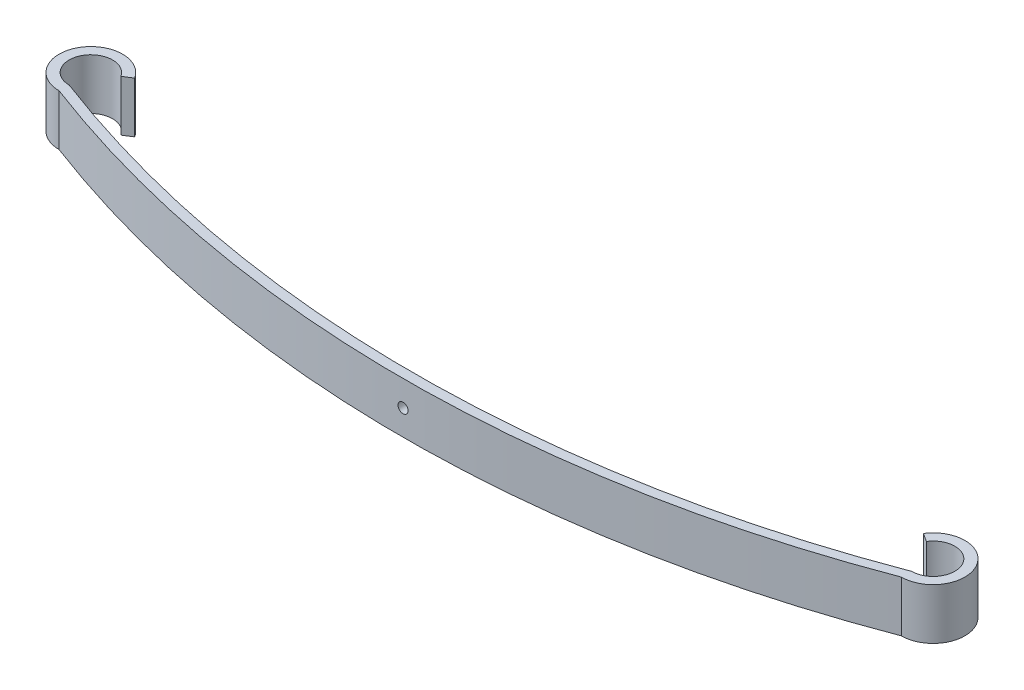
ISO-10303-21;
HEADER;
FILE_DESCRIPTION(('STEP AP214'),'2;1');
FILE_NAME('part.step','',(''),(''),'','','');
FILE_SCHEMA(('AUTOMOTIVE_DESIGN { 1 0 10303 214 1 1 1 1 }'));
ENDSEC;
DATA;
#1=APPLICATION_CONTEXT('core data for automotive mechanical design processes');
#2=APPLICATION_PROTOCOL_DEFINITION('international standard','automotive_design',2000,#1);
#3=PRODUCT_CONTEXT('',#1,'mechanical');
#4=PRODUCT('Part','Part','',(#3));
#5=PRODUCT_RELATED_PRODUCT_CATEGORY('part','',(#4));
#6=PRODUCT_DEFINITION_FORMATION('','',#4);
#7=PRODUCT_DEFINITION_CONTEXT('part definition',#1,'design');
#8=PRODUCT_DEFINITION('design','',#6,#7);
#9=PRODUCT_DEFINITION_SHAPE('','',#8);
#10=(LENGTH_UNIT() NAMED_UNIT(*) SI_UNIT(.MILLI.,.METRE.));
#11=(NAMED_UNIT(*) PLANE_ANGLE_UNIT() SI_UNIT($,.RADIAN.));
#12=(NAMED_UNIT(*) SI_UNIT($,.STERADIAN.) SOLID_ANGLE_UNIT());
#13=UNCERTAINTY_MEASURE_WITH_UNIT(LENGTH_MEASURE(1.E-05),#10,'distance_accuracy_value','');
#14=(GEOMETRIC_REPRESENTATION_CONTEXT(3) GLOBAL_UNCERTAINTY_ASSIGNED_CONTEXT((#13)) GLOBAL_UNIT_ASSIGNED_CONTEXT((#10,
#11,#12)) REPRESENTATION_CONTEXT('',''));
#15=CARTESIAN_POINT('',(0.,0.,0.));
#16=DIRECTION('',(0.,0.,1.));
#17=DIRECTION('',(1.,0.,0.));
#18=AXIS2_PLACEMENT_3D('',#15,#16,#17);
#19=CARTESIAN_POINT('',(0.,76.2,-1613.04997748712));
#20=DIRECTION('',(0.,-1.,0.));
#21=DIRECTION('',(0.,0.,-1.));
#22=AXIS2_PLACEMENT_3D('',#19,#20,#21);
#23=CYLINDRICAL_SURFACE('',#22,1776.04997748712);
#24=CARTESIAN_POINT('',(0.,0.,-1613.04997748712));
#25=DIRECTION('',(0.,1.,0.));
#26=DIRECTION('',(0.,0.,1.));
#27=AXIS2_PLACEMENT_3D('',#24,#25,#26);
#28=CIRCLE('',#27,1776.04997748712);
#29=CARTESIAN_POINT('',(-630.021699517165,0.,47.499985829101));
#30=VERTEX_POINT('',#29);
#31=CARTESIAN_POINT('',(630.021699517166,0.,47.4999858291005));
#32=VERTEX_POINT('',#31);
#33=EDGE_CURVE('E158',#30,#32,#28,.T.);
#34=ORIENTED_EDGE('',*,*,#33,.T.);
#35=DIRECTION('',(0.,-1.,0.));
#36=VECTOR('',#35,1.);
#37=CARTESIAN_POINT('',(630.021699517166,76.2,47.4999858291005));
#38=LINE('',#37,#36);
#39=CARTESIAN_POINT('',(630.021699517166,76.2,47.4999858291005));
#40=VERTEX_POINT('',#39);
#41=EDGE_CURVE('E178',#40,#32,#38,.T.);
#42=ORIENTED_EDGE('',*,*,#41,.F.);
#43=CARTESIAN_POINT('',(0.,76.2,-1613.04997748712));
#44=DIRECTION('',(0.,1.,0.));
#45=DIRECTION('',(0.,0.,1.));
#46=AXIS2_PLACEMENT_3D('',#43,#44,#45);
#47=CIRCLE('',#46,1776.04997748712);
#48=CARTESIAN_POINT('',(-630.021699517165,76.2,47.499985829101));
#49=VERTEX_POINT('',#48);
#50=EDGE_CURVE('E187',#49,#40,#47,.T.);
#51=ORIENTED_EDGE('',*,*,#50,.F.);
#52=DIRECTION('',(0.,-1.,0.));
#53=VECTOR('',#52,1.);
#54=CARTESIAN_POINT('',(-630.021699517165,76.2,47.499985829101));
#55=LINE('',#54,#53);
#56=EDGE_CURVE('E64',#49,#30,#55,.T.);
#57=ORIENTED_EDGE('',*,*,#56,.T.);
#58=EDGE_LOOP('',(#34,#42,#51,#57));
#59=FACE_BOUND('',#58,.T.);
#60=CARTESIAN_POINT('',(0.,30.6,163.));
#61=CARTESIAN_POINT('',(0.210713968094847,30.5999984867718,163.000000017793));
#62=CARTESIAN_POINT('',(0.421403110930927,30.6088837241473,162.999962421728));
#63=CARTESIAN_POINT('',(0.841354181845692,30.6443626478279,162.999813125687));
#64=CARTESIAN_POINT('',(1.05061571988433,30.6709609920997,162.999701406219));
#65=CARTESIAN_POINT('',(1.46633777348713,30.7417152082759,162.999406859924));
#66=CARTESIAN_POINT('',(1.6727956251238,30.7858867143384,162.999223969782));
#67=CARTESIAN_POINT('',(2.0813298290619,30.8914915499317,162.998792209094));
#68=CARTESIAN_POINT('',(2.28340455125413,30.9529311869032,162.99854331444));
#69=CARTESIAN_POINT('',(2.68152110119559,31.0925814227028,162.997986836868));
#70=CARTESIAN_POINT('',(2.87756687230425,31.1707807807116,162.997679293301));
#71=CARTESIAN_POINT('',(3.26237590887557,31.3434199132982,162.997014137911));
#72=CARTESIAN_POINT('',(3.45113906456141,31.4378599325678,162.996656525334));
#73=CARTESIAN_POINT('',(3.81998780496026,31.6422805388219,162.995901490769));
#74=CARTESIAN_POINT('',(4.00007570143526,31.7522569546407,162.995504079474));
#75=CARTESIAN_POINT('',(4.35035222525648,31.9869905222912,162.994680636077));
#76=CARTESIAN_POINT('',(4.52054062300158,32.1117480167399,162.994254603313));
#77=CARTESIAN_POINT('',(4.84979170206728,32.375145131617,162.993386048449));
#78=CARTESIAN_POINT('',(5.00885520931113,32.5137837196366,162.992943527577));
#79=CARTESIAN_POINT('',(5.31479308067832,32.8040158599574,162.992054369382));
#80=CARTESIAN_POINT('',(5.46166320475944,32.9556138817971,162.991607730686));
#81=CARTESIAN_POINT('',(5.74206362701646,33.2705952098568,162.990723311728));
#82=CARTESIAN_POINT('',(5.87559815641376,33.4339747494301,162.990285528692));
#83=CARTESIAN_POINT('',(6.12847828337052,33.771463069239,162.989430939818));
#84=CARTESIAN_POINT('',(6.24781862373926,33.9455757887633,162.989014141786));
#85=CARTESIAN_POINT('',(6.47138111476855,34.3032005309574,162.988213616074));
#86=CARTESIAN_POINT('',(6.57560639321553,34.4867105983519,162.987829881559));
#87=CARTESIAN_POINT('',(6.76822875919974,34.8618615632208,162.98710627353));
#88=CARTESIAN_POINT('',(6.85662560065949,35.0535025870461,162.986766400699));
#89=CARTESIAN_POINT('',(7.01695887812286,35.4435460971781,162.986140178145));
#90=CARTESIAN_POINT('',(7.08889566823637,35.641948437921,162.98585382727));
#91=CARTESIAN_POINT('',(7.21580133308615,36.044112738792,162.985342762279));
#92=CARTESIAN_POINT('',(7.27076981084063,36.2478748241927,162.985118049605));
#93=CARTESIAN_POINT('',(7.36333699178479,36.6592665254971,162.984736685149));
#94=CARTESIAN_POINT('',(7.40093897454986,36.8668954034654,162.984580020515));
#95=CARTESIAN_POINT('',(7.45853120590772,37.2846549482945,162.984339094535));
#96=CARTESIAN_POINT('',(7.47851535225072,37.4947864564644,162.984254858275));
#97=CARTESIAN_POINT('',(7.50070359679291,37.9159102543572,162.984161289859));
#98=CARTESIAN_POINT('',(7.50291408330493,38.1269022075305,162.98415193079));
#99=CARTESIAN_POINT('',(7.48955360463755,38.5484004665783,162.984208322118));
#100=CARTESIAN_POINT('',(7.47397607404442,38.7589065643845,162.984274100248));
#101=CARTESIAN_POINT('',(7.42514452560688,39.1778160268165,162.984478922777));
#102=CARTESIAN_POINT('',(7.39189401428336,39.386219800212,162.984617952642));
#103=CARTESIAN_POINT('',(7.30795445093884,39.7994886750945,162.984965325868));
#104=CARTESIAN_POINT('',(7.25726512758625,40.0043537214701,162.985173670307));
#105=CARTESIAN_POINT('',(7.13880941808649,40.4090816554474,162.985653753506));
#106=CARTESIAN_POINT('',(7.07104334628321,40.6089446350512,162.985925491099));
#107=CARTESIAN_POINT('',(6.9189140997809,41.0022558470403,162.986524655178));
#108=CARTESIAN_POINT('',(6.83455053674624,41.1957039292108,162.986852082966));
#109=CARTESIAN_POINT('',(6.64984230973384,41.5747716673123,162.987553267696));
#110=CARTESIAN_POINT('',(6.54950055498252,41.7603927405778,162.9879270162));
#111=CARTESIAN_POINT('',(6.33350673998429,42.122583443866,162.988710406047));
#112=CARTESIAN_POINT('',(6.21784939085645,42.2991499177426,162.989120059772));
#113=CARTESIAN_POINT('',(5.97209494733965,42.6418601532708,162.98996341449));
#114=CARTESIAN_POINT('',(5.84200303653203,42.8080076231485,162.990397106822));
#115=CARTESIAN_POINT('',(5.56830511634722,43.1287715124287,162.99127634415));
#116=CARTESIAN_POINT('',(5.42469413510144,43.2833836517498,162.991721893463));
#117=CARTESIAN_POINT('',(4.97502421482186,43.7281685004763,162.993057195178));
#118=CARTESIAN_POINT('',(4.64986305950484,43.9996590137956,162.993946551662));
#119=CARTESIAN_POINT('',(4.13197567971222,44.3627081259288,162.995201923407));
#120=CARTESIAN_POINT('',(3.95423770702106,44.4764002086073,162.99560743072));
#121=CARTESIAN_POINT('',(3.58980904910951,44.6884506790732,162.996381434127));
#122=CARTESIAN_POINT('',(3.40311815449504,44.7868087079934,162.996749929354));
#123=CARTESIAN_POINT('',(2.83165300721092,45.0576661242205,162.99778332722));
#124=CARTESIAN_POINT('',(2.4351711412673,45.2061693090257,162.998376934446));
#125=CARTESIAN_POINT('',(1.62308827124555,45.434416916634,162.999304792558));
#126=CARTESIAN_POINT('',(1.20748726904254,45.5141613461807,162.999639043471));
#127=CARTESIAN_POINT('',(0.368800144783214,45.6027859953174,163.000011208188));
#128=CARTESIAN_POINT('',(-0.054285919417941,45.6116667624026,163.000049124283));
#129=CARTESIAN_POINT('',(-0.896132618131327,45.5581931101371,162.999823726225));
#130=CARTESIAN_POINT('',(-1.31489325255173,45.4958386892741,162.999560412067));
#131=CARTESIAN_POINT('',(-1.930343678774,45.350406625668,162.998962948761));
#132=CARTESIAN_POINT('',(-2.13346696571789,45.2932419084602,162.998729895662));
#133=CARTESIAN_POINT('',(-2.53416331768187,45.162045795966,162.998203357605));
#134=CARTESIAN_POINT('',(-2.73173651249232,45.0880147954714,162.997909874061));
#135=CARTESIAN_POINT('',(-3.3140608467634,44.8412313409881,162.996950242197));
#136=CARTESIAN_POINT('',(-3.68878109502357,44.6437020734127,162.996204537467));
#137=CARTESIAN_POINT('',(-4.221481788554,44.302730393453,162.994991984489));
#138=CARTESIAN_POINT('',(-4.39423732139206,44.1815494254651,162.99457188216));
#139=CARTESIAN_POINT('',(-4.72893486876269,43.9250760102937,162.993712173886));
#140=CARTESIAN_POINT('',(-4.89088085068098,43.7897887877032,162.993272575197));
#141=CARTESIAN_POINT('',(-5.20283897410495,43.5060131269224,162.992386135607));
#142=CARTESIAN_POINT('',(-5.35284682055941,43.357519977882,162.991939292171));
#143=CARTESIAN_POINT('',(-5.63977310900411,43.0484737070593,162.99105133538));
#144=CARTESIAN_POINT('',(-5.77669606337014,42.887924777116,162.990610220096));
#145=CARTESIAN_POINT('',(-6.0365563359169,42.555833536128,162.989746002998));
#146=CARTESIAN_POINT('',(-6.15949097179772,42.3842891264944,162.989322904647));
#147=CARTESIAN_POINT('',(-6.39046942201549,42.0314575902558,162.98850682996));
#148=CARTESIAN_POINT('',(-6.49851358458275,41.8501706916276,162.988113852918));
#149=CARTESIAN_POINT('',(-6.69894774113216,41.4791360457968,162.987369158747));
#150=CARTESIAN_POINT('',(-6.79133744698069,41.2893881429433,162.987017442377));
#151=CARTESIAN_POINT('',(-6.95980221242462,40.9027865931224,162.986365267457));
#152=CARTESIAN_POINT('',(-7.03587752593892,40.7059330568036,162.986064808109));
#153=CARTESIAN_POINT('',(-7.17118720449926,40.3064792017954,162.985523618733));
#154=CARTESIAN_POINT('',(-7.23041839084985,40.1038778063368,162.985282899979));
#155=CARTESIAN_POINT('',(-7.33158072491749,39.6944803968452,162.98486817799));
#156=CARTESIAN_POINT('',(-7.37351824975526,39.4876859585833,162.984694150164));
#157=CARTESIAN_POINT('',(-7.43983858987241,39.0712246263158,162.984417572837));
#158=CARTESIAN_POINT('',(-7.46421508897785,38.861556726414,162.984315049055));
#159=CARTESIAN_POINT('',(-7.4952100559816,38.440985489394,162.984184515178));
#160=CARTESIAN_POINT('',(-7.50183466739309,38.2300826050053,162.984156479306));
#161=CARTESIAN_POINT('',(-7.49729604901425,37.8084313167287,162.984175644233));
#162=CARTESIAN_POINT('',(-7.48612970385173,37.5976829463633,162.984222858208));
#163=CARTESIAN_POINT('',(-7.44608319144541,37.177881007496,162.984391205324));
#164=CARTESIAN_POINT('',(-7.41720343879283,36.9688273994433,162.984512336734));
#165=CARTESIAN_POINT('',(-7.34193498439911,36.5538917028773,162.984825082016));
#166=CARTESIAN_POINT('',(-7.29554590651511,36.3480096825962,162.985016697403));
#167=CARTESIAN_POINT('',(-7.18558954382423,35.9408886735015,162.985464967259));
#168=CARTESIAN_POINT('',(-7.12202252604787,35.739649612566,162.985721620717));
#169=CARTESIAN_POINT('',(-6.97814667319725,35.3431999543688,162.986292743016));
#170=CARTESIAN_POINT('',(-6.89783430858538,35.1479906380153,162.986607224044));
#171=CARTESIAN_POINT('',(-6.72107980430754,34.7651040508116,162.987284909401));
#172=CARTESIAN_POINT('',(-6.62464362886641,34.5774240265766,162.987648095704));
#173=CARTESIAN_POINT('',(-6.41627290528495,34.2107950839366,162.988413096412));
#174=CARTESIAN_POINT('',(-6.30433343128879,34.0318489650873,162.988814923083));
#175=CARTESIAN_POINT('',(-6.06581689289905,33.6840847361217,162.989645553125));
#176=CARTESIAN_POINT('',(-5.93924490882258,33.5152631415665,162.990074347111));
#177=CARTESIAN_POINT('',(-5.67231991868896,33.1888660580893,162.990946907972));
#178=CARTESIAN_POINT('',(-5.53196570521886,33.0312915565777,162.991390676156));
#179=CARTESIAN_POINT('',(-5.23848659589199,32.7285285010306,162.992280544971));
#180=CARTESIAN_POINT('',(-5.0853619960534,32.5833396600526,162.992726645546));
#181=CARTESIAN_POINT('',(-4.76738488124468,32.3063385507568,162.993608647806));
#182=CARTESIAN_POINT('',(-4.60252923302687,32.1745298791336,162.994044546725));
#183=CARTESIAN_POINT('',(-4.26230143452232,31.9252727160435,162.994893638276));
#184=CARTESIAN_POINT('',(-4.08692944268893,31.8078240082909,162.995306831249));
#185=CARTESIAN_POINT('',(-3.72679224644598,31.5880456665328,162.996099052417));
#186=CARTESIAN_POINT('',(-3.54202080718423,31.4857262485999,162.996478057458));
#187=CARTESIAN_POINT('',(-3.16457932589499,31.2970641063269,162.997190684133));
#188=CARTESIAN_POINT('',(-2.97191219636429,31.2107155544446,162.997524322307));
#189=CARTESIAN_POINT('',(-2.58015719959558,31.0546324777026,162.998136625653));
#190=CARTESIAN_POINT('',(-2.3810752055734,30.984883219795,162.998415339535));
#191=CARTESIAN_POINT('',(-1.9778114443016,30.8624129523238,162.998910200255));
#192=CARTESIAN_POINT('',(-1.77363103212905,30.8096874689385,162.999126363529));
#193=CARTESIAN_POINT('',(-1.31020489979035,30.7106430274461,162.999535351372));
#194=CARTESIAN_POINT('',(-1.04990557260764,30.6691871109607,162.99970896714));
#195=CARTESIAN_POINT('',(-0.52639125500043,30.6138665423076,162.999941280342));
#196=CARTESIAN_POINT('',(-0.263176264592551,30.6000018899827,162.999999977777));
#197=CARTESIAN_POINT('',(0.,30.6,163.));
#198=B_SPLINE_CURVE_WITH_KNOTS('',3,(#60,#61,#62,#63,#64,#65,#66,#67,#68,#69,#70,#71,#72,#73,
#74,#75,#76,#77,#78,#79,#80,#81,#82,#83,#84,#85,#86,#87,#88,#89,#90,#91,#92,#93,#94,#95,#96,#97,
#98,#99,#100,#101,#102,#103,#104,#105,#106,#107,#108,#109,#110,#111,#112,#113,#114,#115,#116,
#117,#118,#119,#120,#121,#122,#123,#124,#125,#126,#127,#128,#129,#130,#131,#132,#133,#134,#135,
#136,#137,#138,#139,#140,#141,#142,#143,#144,#145,#146,#147,#148,#149,#150,#151,#152,#153,#154,
#155,#156,#157,#158,#159,#160,#161,#162,#163,#164,#165,#166,#167,#168,#169,#170,#171,#172,#173,
#174,#175,#176,#177,#178,#179,#180,#181,#182,#183,#184,#185,#186,#187,#188,#189,#190,#191,#192,
#193,#194,#195,#196,#197),.UNSPECIFIED.,.T.,.F.,(4,2,2,2,2,2,2,2,2,2,2,2,2,2,2,2,2,2,2,2,2,2,2,
2,2,2,2,2,2,2,2,2,2,2,2,2,2,2,2,2,2,2,2,2,2,2,2,2,2,2,2,2,2,2,2,2,2,2,2,2,2,2,2,2,2,2,2,2,4),
(0.,0.631912024301777,1.2639902864152,1.89663214600144,2.52950538839113,3.16195548087539,
3.79441510307562,4.4267052459563,5.0590100478297,5.69126785680884,6.32374460980309,
6.95602004377835,7.58852893310257,8.22090674891288,8.85329439515874,9.48566843538514,
10.1180572691842,10.7503266306474,11.3828149038618,12.0150758342728,12.6475702025455,
13.2799391235442,13.9123178840565,14.5446850047721,15.177066922899,15.8093338315781,
16.4418196509556,17.0740790696136,17.7065719276866,18.9702098092056,19.602583667419,
20.2349723230349,21.4986105469059,22.7622486468442,24.0258769838608,25.2895053477042,
25.9218869189979,26.5542536895501,27.8178774792359,28.450372115571,29.0826333187677,
29.7151209754032,30.3473897231102,30.9797795065627,31.6121544983652,32.2445411283046,
32.8769179149983,33.5094139599539,34.1416765599364,34.7741664524213,35.4064374266601,
36.0388191299599,36.6711860326123,37.3035665208154,37.9359371792494,38.5684412619989,
39.2007118959496,39.8331838838019,40.4654369370645,41.097745429307,41.7300392686787,
42.3625026260201,42.9949564562123,43.6278354202829,44.2604829982539,44.892566944869,
45.5244846453389,46.3137263294984,47.1029680091572),.UNSPECIFIED.);
#199=CARTESIAN_POINT('',(0.,30.6,163.));
#200=VERTEX_POINT('',#199);
#201=EDGE_CURVE('E156',#200,#200,#198,.T.);
#202=ORIENTED_EDGE('',*,*,#201,.F.);
#203=EDGE_LOOP('',(#202));
#204=FACE_BOUND('',#203,.T.);
#205=ADVANCED_FACE('F49',(#59,#204),#23,.T.);
#206=CARTESIAN_POINT('',(0.,76.2,-1627.93787683776));
#207=DIRECTION('',(0.,-1.,0.));
#208=DIRECTION('',(0.,0.,-1.));
#209=AXIS2_PLACEMENT_3D('',#206,#207,#208);
#210=CYLINDRICAL_SURFACE('',#209,1775.93787683776);
#211=CARTESIAN_POINT('',(0.,0.,-1627.93787683776));
#212=DIRECTION('',(0.,1.,0.));
#213=DIRECTION('',(0.,0.,1.));
#214=AXIS2_PLACEMENT_3D('',#211,#212,#213);
#215=CIRCLE('',#214,1775.93787683776);
#216=CARTESIAN_POINT('',(-630.001110861023,0.,32.4999999588662));
#217=VERTEX_POINT('',#216);
#218=CARTESIAN_POINT('',(630.001110861023,0.,32.4999999588662));
#219=VERTEX_POINT('',#218);
#220=EDGE_CURVE('E167',#217,#219,#215,.T.);
#221=ORIENTED_EDGE('',*,*,#220,.F.);
#222=DIRECTION('',(0.,-1.,0.));
#223=VECTOR('',#222,1.);
#224=CARTESIAN_POINT('',(-630.001110861023,76.2,32.4999999588662));
#225=LINE('',#224,#223);
#226=CARTESIAN_POINT('',(-630.001110861023,76.2,32.4999999588662));
#227=VERTEX_POINT('',#226);
#228=EDGE_CURVE('E98',#227,#217,#225,.T.);
#229=ORIENTED_EDGE('',*,*,#228,.F.);
#230=CARTESIAN_POINT('',(0.,76.2,-1627.93787683776));
#231=DIRECTION('',(0.,1.,0.));
#232=DIRECTION('',(0.,0.,1.));
#233=AXIS2_PLACEMENT_3D('',#230,#231,#232);
#234=CIRCLE('',#233,1775.93787683776);
#235=CARTESIAN_POINT('',(630.001110861023,76.2,32.4999999588662));
#236=VERTEX_POINT('',#235);
#237=EDGE_CURVE('E142',#227,#236,#234,.T.);
#238=ORIENTED_EDGE('',*,*,#237,.T.);
#239=DIRECTION('',(0.,-1.,0.));
#240=VECTOR('',#239,1.);
#241=CARTESIAN_POINT('',(630.001110861023,76.2,32.4999999588662));
#242=LINE('',#241,#240);
#243=EDGE_CURVE('E126',#236,#219,#242,.T.);
#244=ORIENTED_EDGE('',*,*,#243,.T.);
#245=EDGE_LOOP('',(#221,#229,#238,#244));
#246=FACE_BOUND('',#245,.T.);
#247=CARTESIAN_POINT('',(-7.5,38.1,147.984163226783));
#248=CARTESIAN_POINT('',(-7.50000151322831,37.889286032042,147.984163208976));
#249=CARTESIAN_POINT('',(-7.49111627586431,37.6785968893444,147.984200807732));
#250=CARTESIAN_POINT('',(-7.45563735223056,37.2586458187078,147.984350114577));
#251=CARTESIAN_POINT('',(-7.42903900799412,37.0493842808088,147.984461842159));
#252=CARTESIAN_POINT('',(-7.35828479191471,36.6336622274907,147.984756409525));
#253=CARTESIAN_POINT('',(-7.31411328591387,36.4272043759991,147.984939312626));
#254=CARTESIAN_POINT('',(-7.20850845047148,36.0186701723505,147.98537110387));
#255=CARTESIAN_POINT('',(-7.14706881358919,35.8165954503028,147.985620016121));
#256=CARTESIAN_POINT('',(-7.00741857799982,35.4184789006545,147.986176532711));
#257=CARTESIAN_POINT('',(-6.92921922011264,35.2224331296943,147.986484097696));
#258=CARTESIAN_POINT('',(-6.75658008780004,34.8376240934111,147.987149299011));
#259=CARTESIAN_POINT('',(-6.66214006868284,34.648860937865,147.987506936096));
#260=CARTESIAN_POINT('',(-6.45771946276266,34.2800121977292,147.988262021889));
#261=CARTESIAN_POINT('',(-6.34774304712516,34.0999243013776,147.988659459903));
#262=CARTESIAN_POINT('',(-6.11300947986454,33.7496477777825,147.989482958067));
#263=CARTESIAN_POINT('',(-5.98825198562445,33.5794593801401,147.98990901888));
#264=CARTESIAN_POINT('',(-5.72485487108066,33.2502083011186,147.990777630265));
#265=CARTESIAN_POINT('',(-5.58621628317439,33.0911447938254,147.991220179609));
#266=CARTESIAN_POINT('',(-5.29598414307773,32.7852069223475,147.992109394363));
#267=CARTESIAN_POINT('',(-5.14438612134884,32.6383367982051,147.992556061145));
#268=CARTESIAN_POINT('',(-4.82940479350428,32.3579363758117,147.993440535017));
#269=CARTESIAN_POINT('',(-4.66602525403511,32.2244018463392,147.993878344881));
#270=CARTESIAN_POINT('',(-4.32853693442408,31.9715217192178,147.994732985544));
#271=CARTESIAN_POINT('',(-4.15442421499347,31.8521813787595,147.995149808536));
#272=CARTESIAN_POINT('',(-3.79679947290188,31.6286188874937,147.995950381655));
#273=CARTESIAN_POINT('',(-3.61328940551239,31.5243936089057,147.996334138618));
#274=CARTESIAN_POINT('',(-3.2381384406307,31.3317712426408,147.997057788571));
#275=CARTESIAN_POINT('',(-3.04649741678751,31.2433744010414,147.997397680879));
#276=CARTESIAN_POINT('',(-2.6564539065972,31.083041123304,147.998023938994));
#277=CARTESIAN_POINT('',(-2.45805156581379,31.011104333056,147.998310305951));
#278=CARTESIAN_POINT('',(-2.05588726484054,30.8841986679462,147.998821399462));
#279=CARTESIAN_POINT('',(-1.85212517937792,30.8292301900662,147.999046124575));
#280=CARTESIAN_POINT('',(-1.44073347808977,30.7366630089189,147.999427510032));
#281=CARTESIAN_POINT('',(-1.23310460020251,30.699061026063,147.999584183227));
#282=CARTESIAN_POINT('',(-0.815345055523425,30.6414687945114,147.999825122358));
#283=CARTESIAN_POINT('',(-0.605213547422562,30.6214846480655,147.999909363204));
#284=CARTESIAN_POINT('',(-0.184089749657962,30.5992964033073,148.000002936698));
#285=CARTESIAN_POINT('',(0.0269022034561126,30.5970859166821,148.00001229626));
#286=CARTESIAN_POINT('',(0.448400462394473,30.6104463951136,147.999955901865));
#287=CARTESIAN_POINT('',(0.658906560150525,30.626023925584,147.999890120175));
#288=CARTESIAN_POINT('',(1.07781602235526,30.6748554737511,147.999685286495));
#289=CARTESIAN_POINT('',(1.28621979557502,30.7081059849155,147.999546249041));
#290=CARTESIAN_POINT('',(1.6994886701179,30.7920455479096,147.999198856751));
#291=CARTESIAN_POINT('',(1.90435371632966,30.8427348710709,147.998990500836));
#292=CARTESIAN_POINT('',(2.30908164999375,30.9611905801557,147.99851039094));
#293=CARTESIAN_POINT('',(2.50894462944824,31.0289566517352,147.998238638125));
#294=CARTESIAN_POINT('',(2.90225584115666,31.1810858977577,147.99763944017));
#295=CARTESIAN_POINT('',(3.09570392319585,31.2654494605363,147.997311993727));
#296=CARTESIAN_POINT('',(3.47477166111625,31.4501576870337,147.996610768592));
#297=CARTESIAN_POINT('',(3.66039273432958,31.5504994415309,147.996236998337));
#298=CARTESIAN_POINT('',(4.02258343753528,31.7664932560006,147.995453562372));
#299=CARTESIAN_POINT('',(4.19914991138165,31.8821506048539,147.995043884278));
#300=CARTESIAN_POINT('',(4.54186014687746,32.1279050478044,147.99420047874));
#301=CARTESIAN_POINT('',(4.70800761675291,32.2579969583204,147.993766759956));
#302=CARTESIAN_POINT('',(5.02877150606054,32.5316948779086,147.992887468353));
#303=CARTESIAN_POINT('',(5.18338364541128,32.6753058588493,147.992441891216));
#304=CARTESIAN_POINT('',(5.6281684945452,33.1249757784679,147.991106505085));
#305=CARTESIAN_POINT('',(5.89965900825297,33.4501369334614,147.990217091007));
#306=CARTESIAN_POINT('',(6.262708121013,33.9680243128369,147.988961636202));
#307=CARTESIAN_POINT('',(6.37640020390802,34.1457622854004,147.988556101746));
#308=CARTESIAN_POINT('',(6.58845067481971,34.5101909430831,147.98778204606));
#309=CARTESIAN_POINT('',(6.68680870396921,34.6968818375964,147.987413525695));
#310=CARTESIAN_POINT('',(6.95766612092456,35.2683469846753,147.986380056772));
#311=CARTESIAN_POINT('',(7.10616930623552,35.6648288505647,147.985786407928));
#312=CARTESIAN_POINT('',(7.3344169148389,36.4769117206066,147.984858484188));
#313=CARTESIAN_POINT('',(7.4141613448755,36.8925127228838,147.984524209266));
#314=CARTESIAN_POINT('',(7.50278599489511,37.7311998469434,147.98415201781));
#315=CARTESIAN_POINT('',(7.51166676244898,38.1542859108626,147.984114098986));
#316=CARTESIAN_POINT('',(7.45819311120801,38.9961326090884,147.984339513262));
#317=CARTESIAN_POINT('',(7.39583869090105,39.4148932433033,147.984602846369));
#318=CARTESIAN_POINT('',(7.25040662822004,40.0303436691592,147.985200352132));
#319=CARTESIAN_POINT('',(7.19324191135916,40.2334669559165,147.985433421733));
#320=CARTESIAN_POINT('',(7.06204579959849,40.6341633075357,147.985959996822));
#321=CARTESIAN_POINT('',(6.98801479949064,40.8317365021881,147.986253500895));
#322=CARTESIAN_POINT('',(6.74123134622537,41.4140608360378,147.987213199286));
#323=CARTESIAN_POINT('',(6.5437020795405,41.7887810840839,147.987958954978));
#324=CARTESIAN_POINT('',(6.20273040089954,42.321481777607,147.989171589012));
#325=CARTESIAN_POINT('',(6.08154943328123,42.4942373105692,147.989591719145));
#326=CARTESIAN_POINT('',(5.82507601884717,42.8289348582217,147.99045148369));
#327=CARTESIAN_POINT('',(5.6897887966242,42.9908808402978,147.990891110846));
#328=CARTESIAN_POINT('',(5.40601313657097,43.302838964075,147.991777607134));
#329=CARTESIAN_POINT('',(5.25751998789042,43.4528468107248,147.992224478804));
#330=CARTESIAN_POINT('',(4.94847371777355,43.739773099599,147.993112491048));
#331=CARTESIAN_POINT('',(4.7879247881763,43.8766960541991,147.993553633553));
#332=CARTESIAN_POINT('',(4.45583354772803,44.1365563273565,147.99441790335));
#333=CARTESIAN_POINT('',(4.28428913827944,44.2594909636028,147.994841027178));
#334=CARTESIAN_POINT('',(3.93145760236956,44.4904694145652,147.995657150479));
#335=CARTESIAN_POINT('',(3.75017070388509,44.5985135775117,147.996050150655));
#336=CARTESIAN_POINT('',(3.37913605829824,44.7989477348284,147.996794888196));
#337=CARTESIAN_POINT('',(3.18938815554505,44.8913374410652,147.9971466248));
#338=CARTESIAN_POINT('',(2.80278660588033,45.0598022072894,147.997798836921));
#339=CARTESIAN_POINT('',(2.60593306961734,45.1358775211958,147.998099313235));
#340=CARTESIAN_POINT('',(2.20647921477898,45.271187200504,147.998640532943));
#341=CARTESIAN_POINT('',(2.0038778194372,45.3304183872189,147.998881265061));
#342=CARTESIAN_POINT('',(1.59448041014118,45.4315807220257,147.999296009968));
#343=CARTESIAN_POINT('',(1.38768597195804,45.4735182472382,147.99947004735));
#344=CARTESIAN_POINT('',(0.971224639811741,45.5398385881106,147.999746639794));
#345=CARTESIAN_POINT('',(0.761556739952338,45.5642150875967,147.999849169136));
#346=CARTESIAN_POINT('',(0.340985502982624,45.5952100553635,147.999979710094));
#347=CARTESIAN_POINT('',(0.130082618601716,45.6018346671574,148.00000774749));
#348=CARTESIAN_POINT('',(-0.291568669517888,45.5972960495444,147.999988581528));
#349=CARTESIAN_POINT('',(-0.502317039734276,45.5861297047798,147.999941364993));
#350=CARTESIAN_POINT('',(-0.922118978336284,45.5460831931951,147.999773008736));
#351=CARTESIAN_POINT('',(-1.13117258627264,45.5172034409662,147.999651870746));
#352=CARTESIAN_POINT('',(-1.54610828263936,45.441934987444,147.999339108337));
#353=CARTESIAN_POINT('',(-1.75199030283742,45.3955459100079,147.999147482405));
#354=CARTESIAN_POINT('',(-2.1591113118013,45.2855895482351,147.998699187702));
#355=CARTESIAN_POINT('',(-2.360350372689,45.2220225309289,147.998442519942));
#356=CARTESIAN_POINT('',(-2.75680003082696,45.07814667904,147.997871365501));
#357=CARTESIAN_POINT('',(-2.95200934716902,44.9978343149198,147.997556866632));
#358=CARTESIAN_POINT('',(-3.33489593439056,44.8210798116437,147.996879142435));
#359=CARTESIAN_POINT('',(-3.5225759586549,44.7246436367126,147.996515935136));
#360=CARTESIAN_POINT('',(-3.88920490139903,44.5162729141668,147.995750889632));
#361=CARTESIAN_POINT('',(-4.06815102032298,44.4043334406961,147.995349039162));
#362=CARTESIAN_POINT('',(-4.41591524948731,44.1658169033682,147.994518359343));
#363=CARTESIAN_POINT('',(-4.58473684416636,44.039244919828,147.994089539381));
#364=CARTESIAN_POINT('',(-4.91113392807934,43.7723199306624,147.993216924991));
#365=CARTESIAN_POINT('',(-5.06870842989352,43.6319657176127,147.992773129254));
#366=CARTESIAN_POINT('',(-5.37147148608213,43.3384866091042,147.991883204517));
#367=CARTESIAN_POINT('',(-5.51666032739907,43.1853620096637,147.991437075571));
#368=CARTESIAN_POINT('',(-5.79366143740971,42.8673848956232,147.990555016557));
#369=CARTESIAN_POINT('',(-5.92547010940867,42.7025292477756,147.990119089256));
#370=CARTESIAN_POINT('',(-6.17472727328675,42.3623014499769,147.989269941828));
#371=CARTESIAN_POINT('',(-6.29217598145138,42.1869294584793,147.98885672136));
#372=CARTESIAN_POINT('',(-6.51195432412411,41.826792262775,147.988064446936));
#373=CARTESIAN_POINT('',(-6.61427374255187,41.6420208237114,147.987685416133));
#374=CARTESIAN_POINT('',(-6.80293588582792,41.2645793427645,147.986972740725));
#375=CARTESIAN_POINT('',(-6.8892844382185,41.0719122133781,147.986639079577));
#376=CARTESIAN_POINT('',(-7.0453675159849,40.6801572168392,147.986026733614));
#377=CARTESIAN_POINT('',(-7.11511677440851,40.4810752229026,147.985748000085));
#378=CARTESIAN_POINT('',(-7.23758704291195,40.0778114617462,147.98525310439));
#379=CARTESIAN_POINT('',(-7.2903125268134,39.8736310496035,147.985036925785));
#380=CARTESIAN_POINT('',(-7.38935697005201,39.4102049144957,147.984627908819));
#381=CARTESIAN_POINT('',(-7.43081288747382,39.1499055844351,147.984454280594));
#382=CARTESIAN_POINT('',(-7.48613345737772,38.6263912609657,147.984221950697));
#383=CARTESIAN_POINT('',(-7.49999811001718,38.3631762675735,147.984163249024));
#384=CARTESIAN_POINT('',(-7.5,38.1,147.984163226783));
#385=B_SPLINE_CURVE_WITH_KNOTS('',3,(#247,#248,#249,#250,#251,#252,#253,#254,#255,#256,#257,
#258,#259,#260,#261,#262,#263,#264,#265,#266,#267,#268,#269,#270,#271,#272,#273,#274,#275,#276,
#277,#278,#279,#280,#281,#282,#283,#284,#285,#286,#287,#288,#289,#290,#291,#292,#293,#294,#295,
#296,#297,#298,#299,#300,#301,#302,#303,#304,#305,#306,#307,#308,#309,#310,#311,#312,#313,#314,
#315,#316,#317,#318,#319,#320,#321,#322,#323,#324,#325,#326,#327,#328,#329,#330,#331,#332,#333,
#334,#335,#336,#337,#338,#339,#340,#341,#342,#343,#344,#345,#346,#347,#348,#349,#350,#351,#352,
#353,#354,#355,#356,#357,#358,#359,#360,#361,#362,#363,#364,#365,#366,#367,#368,#369,#370,#371,
#372,#373,#374,#375,#376,#377,#378,#379,#380,#381,#382,#383,#384),.UNSPECIFIED.,.T.,.F.,(4,2,2,
2,2,2,2,2,2,2,2,2,2,2,2,2,2,2,2,2,2,2,2,2,2,2,2,2,2,2,2,2,2,2,2,2,2,2,2,2,2,2,2,2,2,2,2,2,2,2,2,
2,2,2,2,2,2,2,2,2,2,2,2,2,2,2,2,2,4),(0.,0.631912023888162,1.26399028558467,1.89663214474084,
2.52950538670042,3.16195547873085,3.79441510047781,4.42670524291196,5.05901004433925,
5.69126785338632,6.3237446064486,6.95602004049196,7.58852892988423,8.22090674601172,
8.8532943925744,9.48566843311607,10.11805726723,10.750326628521,11.3828149015632,
12.0150758317994,12.6475701998973,13.2799391203159,13.9123178802482,14.544685000384,
15.1770669179314,15.8093338262271,16.4418196452211,17.0740790634996,17.7065719211931,
18.9702098030776,19.6025836614748,20.2349723172743,21.4986105416874,22.7622486421571,
24.0258769783549,25.2895053413757,25.9218869119052,26.5542536816931,27.8178774698619,
28.4503721060318,29.0826333090643,29.7151209655375,30.3473897130826,30.979779496875,
31.6121544890178,32.2445411192962,32.8769179063283,33.509413951299,34.1416765512958,
34.7741664437928,35.4064374180431,36.0388191208355,36.6711860229802,37.3035665106745,
37.9359371686,38.5684412508377,39.2007118842774,39.8331838716217,40.4654369243774,
41.0977454166334,41.7300392560191,42.3625026133737,42.994956443579,43.6278354079864,
44.2604829862937,44.8925669332538,45.5244846340708,46.3137263271672,47.1029680157623),.UNSPECIFIED.);
#386=CARTESIAN_POINT('',(-7.5,38.1,147.984163226783));
#387=VERTEX_POINT('',#386);
#388=EDGE_CURVE('E53',#387,#387,#385,.T.);
#389=ORIENTED_EDGE('',*,*,#388,.T.);
#390=EDGE_LOOP('',(#389));
#391=FACE_BOUND('',#390,.T.);
#392=ADVANCED_FACE('F146',(#246,#391),#210,.F.);
#393=CARTESIAN_POINT('',(-181.548296211492,76.2,-285.334264952432));
#394=DIRECTION('',(-0.536816447911575,0.,-0.843699058463146));
#395=DIRECTION('',(-0.843699058463146,0.,0.536816447911575));
#396=AXIS2_PLACEMENT_3D('',#393,#394,#395);
#397=PLANE('',#396);
#398=DIRECTION('',(0.843699058463146,0.,-0.536816447911575));
#399=VECTOR('',#398,1.);
#400=CARTESIAN_POINT('',(-181.548296211492,0.,-285.334264952432));
#401=LINE('',#400,#399);
#402=CARTESIAN_POINT('',(-602.579780618635,0.,-17.4465345452363));
#403=VERTEX_POINT('',#402);
#404=CARTESIAN_POINT('',(-589.924302497166,0.,-25.4987763293682));
#405=VERTEX_POINT('',#404);
#406=EDGE_CURVE('E153',#403,#405,#401,.T.);
#407=ORIENTED_EDGE('',*,*,#406,.T.);
#408=DIRECTION('',(0.,-1.,0.));
#409=VECTOR('',#408,1.);
#410=CARTESIAN_POINT('',(-589.924302497166,76.2,-25.4987763293682));
#411=LINE('',#410,#409);
#412=CARTESIAN_POINT('',(-589.924302497166,76.2,-25.4987763293682));
#413=VERTEX_POINT('',#412);
#414=EDGE_CURVE('E11',#413,#405,#411,.T.);
#415=ORIENTED_EDGE('',*,*,#414,.F.);
#416=DIRECTION('',(0.843699058463146,0.,-0.536816447911575));
#417=VECTOR('',#416,1.);
#418=CARTESIAN_POINT('',(-181.548296211492,76.2,-285.334264952432));
#419=LINE('',#418,#417);
#420=CARTESIAN_POINT('',(-602.579780618635,76.2,-17.4465345452363));
#421=VERTEX_POINT('',#420);
#422=EDGE_CURVE('E172',#421,#413,#419,.T.);
#423=ORIENTED_EDGE('',*,*,#422,.F.);
#424=DIRECTION('',(0.,-1.,0.));
#425=VECTOR('',#424,1.);
#426=CARTESIAN_POINT('',(-602.579780618635,76.2,-17.4465345452363));
#427=LINE('',#426,#425);
#428=EDGE_CURVE('E72',#421,#403,#427,.T.);
#429=ORIENTED_EDGE('',*,*,#428,.T.);
#430=EDGE_LOOP('',(#407,#415,#423,#429));
#431=FACE_BOUND('',#430,.T.);
#432=ADVANCED_FACE('F51',(#431),#397,.F.);
#433=CARTESIAN_POINT('',(-630.,76.2,0.));
#434=DIRECTION('',(0.,-1.,0.));
#435=DIRECTION('',(0.,0.,-1.));
#436=AXIS2_PLACEMENT_3D('',#433,#434,#435);
#437=CYLINDRICAL_SURFACE('',#436,47.4999907856183);
#438=CARTESIAN_POINT('',(-630.,0.,0.));
#439=DIRECTION('',(0.,1.,0.));
#440=DIRECTION('',(0.,0.,1.));
#441=AXIS2_PLACEMENT_3D('',#438,#439,#440);
#442=CIRCLE('',#441,47.4999907856183);
#443=EDGE_CURVE('E155',#405,#30,#442,.T.);
#444=ORIENTED_EDGE('',*,*,#443,.T.);
#445=ORIENTED_EDGE('',*,*,#56,.F.);
#446=CARTESIAN_POINT('',(-630.,76.2,0.));
#447=DIRECTION('',(0.,1.,0.));
#448=DIRECTION('',(0.,0.,1.));
#449=AXIS2_PLACEMENT_3D('',#446,#447,#448);
#450=CIRCLE('',#449,47.4999907856183);
#451=EDGE_CURVE('E110',#413,#49,#450,.T.);
#452=ORIENTED_EDGE('',*,*,#451,.F.);
#453=ORIENTED_EDGE('',*,*,#414,.T.);
#454=EDGE_LOOP('',(#444,#445,#452,#453));
#455=FACE_BOUND('',#454,.T.);
#456=ADVANCED_FACE('F230',(#455),#437,.T.);
#457=CARTESIAN_POINT('',(630.,76.2,0.));
#458=DIRECTION('',(0.,-1.,0.));
#459=DIRECTION('',(0.,0.,-1.));
#460=AXIS2_PLACEMENT_3D('',#457,#458,#459);
#461=CYLINDRICAL_SURFACE('',#460,47.4999907856181);
#462=CARTESIAN_POINT('',(630.,0.,0.));
#463=DIRECTION('',(0.,1.,0.));
#464=DIRECTION('',(0.,0.,1.));
#465=AXIS2_PLACEMENT_3D('',#462,#463,#464);
#466=CIRCLE('',#465,47.4999907856181);
#467=CARTESIAN_POINT('',(589.924302497166,0.,-25.4987763293682));
#468=VERTEX_POINT('',#467);
#469=EDGE_CURVE('E160',#32,#468,#466,.T.);
#470=ORIENTED_EDGE('',*,*,#469,.T.);
#471=DIRECTION('',(0.,-1.,0.));
#472=VECTOR('',#471,1.);
#473=CARTESIAN_POINT('',(589.924302497166,76.2,-25.4987763293682));
#474=LINE('',#473,#472);
#475=CARTESIAN_POINT('',(589.924302497166,76.2,-25.4987763293682));
#476=VERTEX_POINT('',#475);
#477=EDGE_CURVE('E176',#476,#468,#474,.T.);
#478=ORIENTED_EDGE('',*,*,#477,.F.);
#479=CARTESIAN_POINT('',(630.,76.2,0.));
#480=DIRECTION('',(0.,1.,0.));
#481=DIRECTION('',(0.,0.,1.));
#482=AXIS2_PLACEMENT_3D('',#479,#480,#481);
#483=CIRCLE('',#482,47.4999907856181);
#484=EDGE_CURVE('E196',#40,#476,#483,.T.);
#485=ORIENTED_EDGE('',*,*,#484,.F.);
#486=ORIENTED_EDGE('',*,*,#41,.T.);
#487=EDGE_LOOP('',(#470,#478,#485,#486));
#488=FACE_BOUND('',#487,.T.);
#489=ADVANCED_FACE('F194',(#488),#461,.T.);
#490=CARTESIAN_POINT('',(181.548296211494,76.2,-285.334264952432));
#491=DIRECTION('',(-0.536816447911577,0.,0.843699058463145));
#492=DIRECTION('',(0.843699058463145,0.,0.536816447911577));
#493=AXIS2_PLACEMENT_3D('',#490,#491,#492);
#494=PLANE('',#493);
#495=DIRECTION('',(-0.843699058463145,0.,-0.536816447911577));
#496=VECTOR('',#495,1.);
#497=CARTESIAN_POINT('',(181.548296211494,0.,-285.334264952432));
#498=LINE('',#497,#496);
#499=CARTESIAN_POINT('',(602.579780618635,0.,-17.4465345452363));
#500=VERTEX_POINT('',#499);
#501=EDGE_CURVE('E163',#500,#468,#498,.T.);
#502=ORIENTED_EDGE('',*,*,#501,.F.);
#503=DIRECTION('',(0.,-1.,0.));
#504=VECTOR('',#503,1.);
#505=CARTESIAN_POINT('',(602.579780618635,76.2,-17.4465345452363));
#506=LINE('',#505,#504);
#507=CARTESIAN_POINT('',(602.579780618635,76.2,-17.4465345452363));
#508=VERTEX_POINT('',#507);
#509=EDGE_CURVE('E135',#508,#500,#506,.T.);
#510=ORIENTED_EDGE('',*,*,#509,.F.);
#511=DIRECTION('',(-0.843699058463145,0.,-0.536816447911577));
#512=VECTOR('',#511,1.);
#513=CARTESIAN_POINT('',(181.548296211494,76.2,-285.334264952432));
#514=LINE('',#513,#512);
#515=EDGE_CURVE('E144',#508,#476,#514,.T.);
#516=ORIENTED_EDGE('',*,*,#515,.T.);
#517=ORIENTED_EDGE('',*,*,#477,.T.);
#518=EDGE_LOOP('',(#502,#510,#516,#517));
#519=FACE_BOUND('',#518,.T.);
#520=ADVANCED_FACE('F226',(#519),#494,.T.);
#521=CARTESIAN_POINT('',(630.,76.2,0.));
#522=DIRECTION('',(0.,-1.,0.));
#523=DIRECTION('',(0.,0.,-1.));
#524=AXIS2_PLACEMENT_3D('',#521,#522,#523);
#525=CYLINDRICAL_SURFACE('',#524,32.499999977851);
#526=CARTESIAN_POINT('',(630.,0.,0.));
#527=DIRECTION('',(0.,1.,0.));
#528=DIRECTION('',(0.,0.,1.));
#529=AXIS2_PLACEMENT_3D('',#526,#527,#528);
#530=CIRCLE('',#529,32.499999977851);
#531=EDGE_CURVE('E131',#219,#500,#530,.T.);
#532=ORIENTED_EDGE('',*,*,#531,.F.);
#533=ORIENTED_EDGE('',*,*,#243,.F.);
#534=CARTESIAN_POINT('',(630.,76.2,0.));
#535=DIRECTION('',(0.,1.,0.));
#536=DIRECTION('',(0.,0.,1.));
#537=AXIS2_PLACEMENT_3D('',#534,#535,#536);
#538=CIRCLE('',#537,32.499999977851);
#539=EDGE_CURVE('E129',#236,#508,#538,.T.);
#540=ORIENTED_EDGE('',*,*,#539,.T.);
#541=ORIENTED_EDGE('',*,*,#509,.T.);
#542=EDGE_LOOP('',(#532,#533,#540,#541));
#543=FACE_BOUND('',#542,.T.);
#544=ADVANCED_FACE('F128',(#543),#525,.F.);
#545=CARTESIAN_POINT('',(-630.,76.2,0.));
#546=DIRECTION('',(0.,-1.,0.));
#547=DIRECTION('',(0.,0.,-1.));
#548=AXIS2_PLACEMENT_3D('',#545,#546,#547);
#549=CYLINDRICAL_SURFACE('',#548,32.4999999778511);
#550=CARTESIAN_POINT('',(-630.,0.,0.));
#551=DIRECTION('',(0.,1.,0.));
#552=DIRECTION('',(0.,0.,1.));
#553=AXIS2_PLACEMENT_3D('',#550,#551,#552);
#554=CIRCLE('',#553,32.4999999778511);
#555=EDGE_CURVE('E169',#403,#217,#554,.T.);
#556=ORIENTED_EDGE('',*,*,#555,.F.);
#557=ORIENTED_EDGE('',*,*,#428,.F.);
#558=CARTESIAN_POINT('',(-630.,76.2,0.));
#559=DIRECTION('',(0.,1.,0.));
#560=DIRECTION('',(0.,0.,1.));
#561=AXIS2_PLACEMENT_3D('',#558,#559,#560);
#562=CIRCLE('',#561,32.4999999778511);
#563=EDGE_CURVE('E148',#421,#227,#562,.T.);
#564=ORIENTED_EDGE('',*,*,#563,.T.);
#565=ORIENTED_EDGE('',*,*,#228,.T.);
#566=EDGE_LOOP('',(#556,#557,#564,#565));
#567=FACE_BOUND('',#566,.T.);
#568=ADVANCED_FACE('F217',(#567),#549,.F.);
#569=CARTESIAN_POINT('',(0.,76.2,0.));
#570=DIRECTION('',(0.,1.,0.));
#571=DIRECTION('',(0.,0.,1.));
#572=AXIS2_PLACEMENT_3D('',#569,#570,#571);
#573=PLANE('',#572);
#574=ORIENTED_EDGE('',*,*,#422,.T.);
#575=ORIENTED_EDGE('',*,*,#451,.T.);
#576=ORIENTED_EDGE('',*,*,#50,.T.);
#577=ORIENTED_EDGE('',*,*,#484,.T.);
#578=ORIENTED_EDGE('',*,*,#515,.F.);
#579=ORIENTED_EDGE('',*,*,#539,.F.);
#580=ORIENTED_EDGE('',*,*,#237,.F.);
#581=ORIENTED_EDGE('',*,*,#563,.F.);
#582=EDGE_LOOP('',(#574,#575,#576,#577,#578,#579,#580,#581));
#583=FACE_BOUND('',#582,.T.);
#584=ADVANCED_FACE('F140',(#583),#573,.T.);
#585=CARTESIAN_POINT('',(0.,0.,0.));
#586=DIRECTION('',(0.,1.,0.));
#587=DIRECTION('',(0.,0.,1.));
#588=AXIS2_PLACEMENT_3D('',#585,#586,#587);
#589=PLANE('',#588);
#590=ORIENTED_EDGE('',*,*,#406,.F.);
#591=ORIENTED_EDGE('',*,*,#555,.T.);
#592=ORIENTED_EDGE('',*,*,#220,.T.);
#593=ORIENTED_EDGE('',*,*,#531,.T.);
#594=ORIENTED_EDGE('',*,*,#501,.T.);
#595=ORIENTED_EDGE('',*,*,#469,.F.);
#596=ORIENTED_EDGE('',*,*,#33,.F.);
#597=ORIENTED_EDGE('',*,*,#443,.F.);
#598=EDGE_LOOP('',(#590,#591,#592,#593,#594,#595,#596,#597));
#599=FACE_BOUND('',#598,.T.);
#600=ADVANCED_FACE('F190',(#599),#589,.F.);
#601=CARTESIAN_POINT('',(0.,38.1,163.));
#602=DIRECTION('',(0.,0.,-1.));
#603=DIRECTION('',(-1.,0.,0.));
#604=AXIS2_PLACEMENT_3D('',#601,#602,#603);
#605=CYLINDRICAL_SURFACE('',#604,7.5);
#606=ORIENTED_EDGE('',*,*,#388,.F.);
#607=EDGE_LOOP('',(#606));
#608=FACE_BOUND('',#607,.T.);
#609=ORIENTED_EDGE('',*,*,#201,.T.);
#610=EDGE_LOOP('',(#609));
#611=FACE_BOUND('',#610,.T.);
#612=ADVANCED_FACE('F209',(#608,#611),#605,.F.);
#613=CLOSED_SHELL('',(#205,#392,#432,#456,#489,#520,#544,#568,#584,#600,#612));
#614=MANIFOLD_SOLID_BREP('B2',#613);
#615=ADVANCED_BREP_SHAPE_REPRESENTATION('',(#18,#614),#14);
#616=SHAPE_DEFINITION_REPRESENTATION(#9,#615);
ENDSEC;
END-ISO-10303-21;
